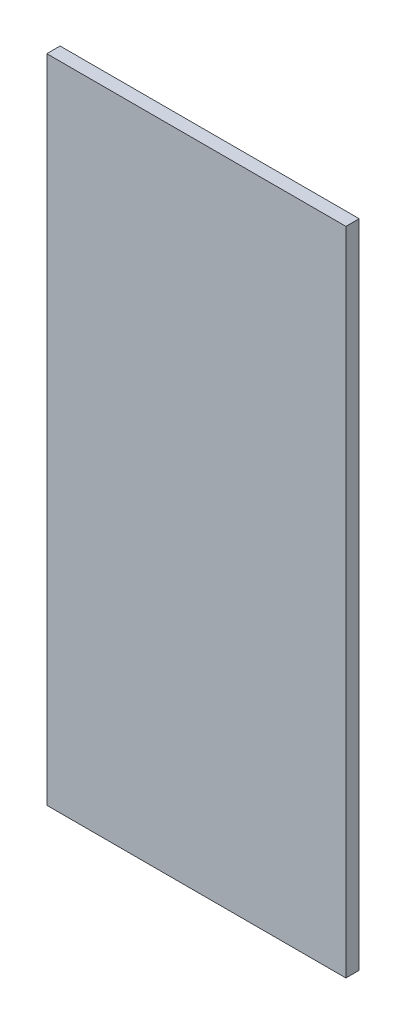
ISO-10303-21;
HEADER;
FILE_DESCRIPTION(('STEP AP214'),'2;1');
FILE_NAME('part.step','',(''),(''),'','','');
FILE_SCHEMA(('AUTOMOTIVE_DESIGN { 1 0 10303 214 1 1 1 1 }'));
ENDSEC;
DATA;
#1=APPLICATION_CONTEXT('core data for automotive mechanical design processes');
#2=APPLICATION_PROTOCOL_DEFINITION('international standard','automotive_design',2000,#1);
#3=PRODUCT_CONTEXT('',#1,'mechanical');
#4=PRODUCT('Part','Part','',(#3));
#5=PRODUCT_RELATED_PRODUCT_CATEGORY('part','',(#4));
#6=PRODUCT_DEFINITION_FORMATION('','',#4);
#7=PRODUCT_DEFINITION_CONTEXT('part definition',#1,'design');
#8=PRODUCT_DEFINITION('design','',#6,#7);
#9=PRODUCT_DEFINITION_SHAPE('','',#8);
#10=(LENGTH_UNIT() NAMED_UNIT(*) SI_UNIT(.MILLI.,.METRE.));
#11=(NAMED_UNIT(*) PLANE_ANGLE_UNIT() SI_UNIT($,.RADIAN.));
#12=(NAMED_UNIT(*) SI_UNIT($,.STERADIAN.) SOLID_ANGLE_UNIT());
#13=UNCERTAINTY_MEASURE_WITH_UNIT(LENGTH_MEASURE(1.E-05),#10,'distance_accuracy_value','');
#14=(GEOMETRIC_REPRESENTATION_CONTEXT(3) GLOBAL_UNCERTAINTY_ASSIGNED_CONTEXT((#13)) GLOBAL_UNIT_ASSIGNED_CONTEXT((#10,
#11,#12)) REPRESENTATION_CONTEXT('',''));
#15=CARTESIAN_POINT('',(0.,0.,0.));
#16=DIRECTION('',(0.,0.,1.));
#17=DIRECTION('',(1.,0.,0.));
#18=AXIS2_PLACEMENT_3D('',#15,#16,#17);
#19=CARTESIAN_POINT('',(70.95,199.079255551711,4.));
#20=DIRECTION('',(-1.,0.,0.));
#21=DIRECTION('',(0.,0.,1.));
#22=AXIS2_PLACEMENT_3D('',#19,#20,#21);
#23=PLANE('',#22);
#24=DIRECTION('',(0.,1.,0.));
#25=VECTOR('',#24,1.);
#26=CARTESIAN_POINT('',(70.95,199.079255551711,0.));
#27=LINE('',#26,#25);
#28=CARTESIAN_POINT('',(70.95,199.079255551711,0.));
#29=VERTEX_POINT('',#28);
#30=CARTESIAN_POINT('',(70.95,394.950026988004,0.));
#31=VERTEX_POINT('',#30);
#32=EDGE_CURVE('E102',#29,#31,#27,.T.);
#33=ORIENTED_EDGE('',*,*,#32,.T.);
#34=DIRECTION('',(0.,0.,-1.));
#35=VECTOR('',#34,1.);
#36=CARTESIAN_POINT('',(70.95,394.950026988004,4.));
#37=LINE('',#36,#35);
#38=CARTESIAN_POINT('',(70.95,394.950026988004,4.));
#39=VERTEX_POINT('',#38);
#40=EDGE_CURVE('E11',#39,#31,#37,.T.);
#41=ORIENTED_EDGE('',*,*,#40,.F.);
#42=DIRECTION('',(0.,1.,0.));
#43=VECTOR('',#42,1.);
#44=CARTESIAN_POINT('',(70.95,199.079255551711,4.));
#45=LINE('',#44,#43);
#46=CARTESIAN_POINT('',(70.95,199.079255551711,4.));
#47=VERTEX_POINT('',#46);
#48=EDGE_CURVE('E90',#47,#39,#45,.T.);
#49=ORIENTED_EDGE('',*,*,#48,.F.);
#50=DIRECTION('',(0.,0.,-1.));
#51=VECTOR('',#50,1.);
#52=CARTESIAN_POINT('',(70.95,199.079255551711,4.));
#53=LINE('',#52,#51);
#54=EDGE_CURVE('E98',#47,#29,#53,.T.);
#55=ORIENTED_EDGE('',*,*,#54,.T.);
#56=EDGE_LOOP('',(#33,#41,#49,#55));
#57=FACE_BOUND('',#56,.T.);
#58=ADVANCED_FACE('F39',(#57),#23,.F.);
#59=CARTESIAN_POINT('',(70.95,394.950026988004,4.));
#60=DIRECTION('',(0.,-1.,0.));
#61=DIRECTION('',(0.,0.,-1.));
#62=AXIS2_PLACEMENT_3D('',#59,#60,#61);
#63=PLANE('',#62);
#64=DIRECTION('',(-1.,0.,0.));
#65=VECTOR('',#64,1.);
#66=CARTESIAN_POINT('',(70.95,394.950026988004,0.));
#67=LINE('',#66,#65);
#68=CARTESIAN_POINT('',(-19.05,394.950026988004,0.));
#69=VERTEX_POINT('',#68);
#70=EDGE_CURVE('E94',#31,#69,#67,.T.);
#71=ORIENTED_EDGE('',*,*,#70,.T.);
#72=DIRECTION('',(0.,0.,-1.));
#73=VECTOR('',#72,1.);
#74=CARTESIAN_POINT('',(-19.05,394.950026988004,4.));
#75=LINE('',#74,#73);
#76=CARTESIAN_POINT('',(-19.05,394.950026988004,4.));
#77=VERTEX_POINT('',#76);
#78=EDGE_CURVE('E47',#77,#69,#75,.T.);
#79=ORIENTED_EDGE('',*,*,#78,.F.);
#80=DIRECTION('',(-1.,0.,0.));
#81=VECTOR('',#80,1.);
#82=CARTESIAN_POINT('',(70.95,394.950026988004,4.));
#83=LINE('',#82,#81);
#84=EDGE_CURVE('E85',#39,#77,#83,.T.);
#85=ORIENTED_EDGE('',*,*,#84,.F.);
#86=ORIENTED_EDGE('',*,*,#40,.T.);
#87=EDGE_LOOP('',(#71,#79,#85,#86));
#88=FACE_BOUND('',#87,.T.);
#89=ADVANCED_FACE('F93',(#88),#63,.F.);
#90=CARTESIAN_POINT('',(-19.05,199.079255551711,4.));
#91=DIRECTION('',(1.,0.,0.));
#92=DIRECTION('',(0.,0.,-1.));
#93=AXIS2_PLACEMENT_3D('',#90,#91,#92);
#94=PLANE('',#93);
#95=DIRECTION('',(0.,-1.,0.));
#96=VECTOR('',#95,1.);
#97=CARTESIAN_POINT('',(-19.05,199.079255551711,0.));
#98=LINE('',#97,#96);
#99=CARTESIAN_POINT('',(-19.05,199.079255551711,0.));
#100=VERTEX_POINT('',#99);
#101=EDGE_CURVE('E72',#69,#100,#98,.T.);
#102=ORIENTED_EDGE('',*,*,#101,.T.);
#103=DIRECTION('',(0.,0.,-1.));
#104=VECTOR('',#103,1.);
#105=CARTESIAN_POINT('',(-19.05,199.079255551711,4.));
#106=LINE('',#105,#104);
#107=CARTESIAN_POINT('',(-19.05,199.079255551711,4.));
#108=VERTEX_POINT('',#107);
#109=EDGE_CURVE('E95',#108,#100,#106,.T.);
#110=ORIENTED_EDGE('',*,*,#109,.F.);
#111=DIRECTION('',(0.,-1.,0.));
#112=VECTOR('',#111,1.);
#113=CARTESIAN_POINT('',(-19.05,199.079255551711,4.));
#114=LINE('',#113,#112);
#115=EDGE_CURVE('E88',#77,#108,#114,.T.);
#116=ORIENTED_EDGE('',*,*,#115,.F.);
#117=ORIENTED_EDGE('',*,*,#78,.T.);
#118=EDGE_LOOP('',(#102,#110,#116,#117));
#119=FACE_BOUND('',#118,.T.);
#120=ADVANCED_FACE('F96',(#119),#94,.F.);
#121=CARTESIAN_POINT('',(70.95,199.079255551711,4.));
#122=DIRECTION('',(0.,1.,0.));
#123=DIRECTION('',(0.,0.,1.));
#124=AXIS2_PLACEMENT_3D('',#121,#122,#123);
#125=PLANE('',#124);
#126=DIRECTION('',(1.,0.,0.));
#127=VECTOR('',#126,1.);
#128=CARTESIAN_POINT('',(70.95,199.079255551711,0.));
#129=LINE('',#128,#127);
#130=EDGE_CURVE('E78',#100,#29,#129,.T.);
#131=ORIENTED_EDGE('',*,*,#130,.T.);
#132=ORIENTED_EDGE('',*,*,#54,.F.);
#133=DIRECTION('',(1.,0.,0.));
#134=VECTOR('',#133,1.);
#135=CARTESIAN_POINT('',(70.95,199.079255551711,4.));
#136=LINE('',#135,#134);
#137=EDGE_CURVE('E55',#108,#47,#136,.T.);
#138=ORIENTED_EDGE('',*,*,#137,.F.);
#139=ORIENTED_EDGE('',*,*,#109,.T.);
#140=EDGE_LOOP('',(#131,#132,#138,#139));
#141=FACE_BOUND('',#140,.T.);
#142=ADVANCED_FACE('F109',(#141),#125,.F.);
#143=CARTESIAN_POINT('',(0.,0.,4.));
#144=DIRECTION('',(0.,0.,1.));
#145=DIRECTION('',(1.,0.,0.));
#146=AXIS2_PLACEMENT_3D('',#143,#144,#145);
#147=PLANE('',#146);
#148=ORIENTED_EDGE('',*,*,#48,.T.);
#149=ORIENTED_EDGE('',*,*,#84,.T.);
#150=ORIENTED_EDGE('',*,*,#115,.T.);
#151=ORIENTED_EDGE('',*,*,#137,.T.);
#152=EDGE_LOOP('',(#148,#149,#150,#151));
#153=FACE_BOUND('',#152,.T.);
#154=ADVANCED_FACE('F86',(#153),#147,.T.);
#155=CARTESIAN_POINT('',(0.,0.,0.));
#156=DIRECTION('',(0.,0.,1.));
#157=DIRECTION('',(1.,0.,0.));
#158=AXIS2_PLACEMENT_3D('',#155,#156,#157);
#159=PLANE('',#158);
#160=ORIENTED_EDGE('',*,*,#32,.F.);
#161=ORIENTED_EDGE('',*,*,#130,.F.);
#162=ORIENTED_EDGE('',*,*,#101,.F.);
#163=ORIENTED_EDGE('',*,*,#70,.F.);
#164=EDGE_LOOP('',(#160,#161,#162,#163));
#165=FACE_BOUND('',#164,.T.);
#166=ADVANCED_FACE('F112',(#165),#159,.F.);
#167=CLOSED_SHELL('',(#58,#89,#120,#142,#154,#166));
#168=MANIFOLD_SOLID_BREP('B2',#167);
#169=ADVANCED_BREP_SHAPE_REPRESENTATION('',(#18,#168),#14);
#170=SHAPE_DEFINITION_REPRESENTATION(#9,#169);
ENDSEC;
END-ISO-10303-21;
